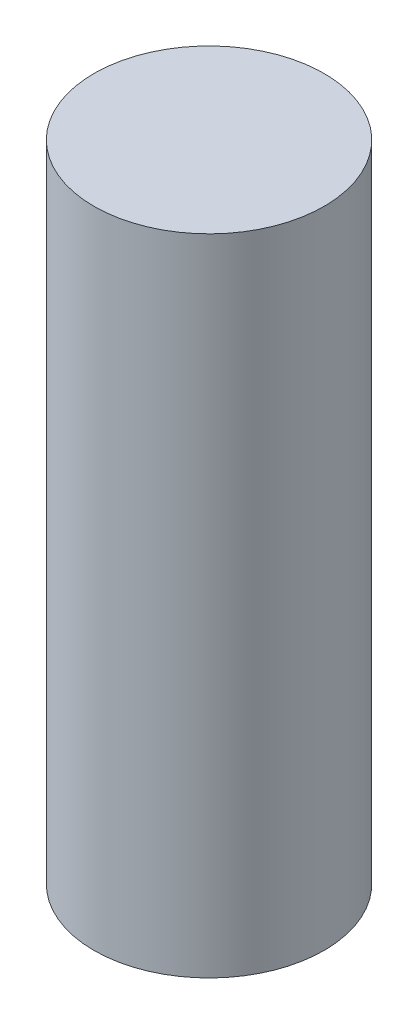
ISO-10303-21;
HEADER;
FILE_DESCRIPTION(('STEP AP214'),'2;1');
FILE_NAME('part.step','',(''),(''),'','','');
FILE_SCHEMA(('AUTOMOTIVE_DESIGN { 1 0 10303 214 1 1 1 1 }'));
ENDSEC;
DATA;
#1=APPLICATION_CONTEXT('core data for automotive mechanical design processes');
#2=APPLICATION_PROTOCOL_DEFINITION('international standard','automotive_design',2000,#1);
#3=PRODUCT_CONTEXT('',#1,'mechanical');
#4=PRODUCT('Part','Part','',(#3));
#5=PRODUCT_RELATED_PRODUCT_CATEGORY('part','',(#4));
#6=PRODUCT_DEFINITION_FORMATION('','',#4);
#7=PRODUCT_DEFINITION_CONTEXT('part definition',#1,'design');
#8=PRODUCT_DEFINITION('design','',#6,#7);
#9=PRODUCT_DEFINITION_SHAPE('','',#8);
#10=(LENGTH_UNIT() NAMED_UNIT(*) SI_UNIT(.MILLI.,.METRE.));
#11=(NAMED_UNIT(*) PLANE_ANGLE_UNIT() SI_UNIT($,.RADIAN.));
#12=(NAMED_UNIT(*) SI_UNIT($,.STERADIAN.) SOLID_ANGLE_UNIT());
#13=UNCERTAINTY_MEASURE_WITH_UNIT(LENGTH_MEASURE(1.E-05),#10,'distance_accuracy_value','');
#14=(GEOMETRIC_REPRESENTATION_CONTEXT(3) GLOBAL_UNCERTAINTY_ASSIGNED_CONTEXT((#13)) GLOBAL_UNIT_ASSIGNED_CONTEXT((#10,
#11,#12)) REPRESENTATION_CONTEXT('',''));
#15=CARTESIAN_POINT('',(0.,0.,0.));
#16=DIRECTION('',(0.,0.,1.));
#17=DIRECTION('',(1.,0.,0.));
#18=AXIS2_PLACEMENT_3D('',#15,#16,#17);
#19=CARTESIAN_POINT('',(0.,17.78,0.));
#20=DIRECTION('',(0.,-1.,0.));
#21=DIRECTION('',(0.,0.,-1.));
#22=AXIS2_PLACEMENT_3D('',#19,#20,#21);
#23=CYLINDRICAL_SURFACE('',#22,3.175);
#24=CARTESIAN_POINT('',(0.,17.78,0.));
#25=DIRECTION('',(0.,1.,0.));
#26=DIRECTION('',(0.,0.,1.));
#27=AXIS2_PLACEMENT_3D('',#24,#25,#26);
#28=CIRCLE('',#27,3.175);
#29=CARTESIAN_POINT('',(0.,17.78,3.175));
#30=VERTEX_POINT('',#29);
#31=EDGE_CURVE('E10',#30,#30,#28,.T.);
#32=ORIENTED_EDGE('',*,*,#31,.F.);
#33=EDGE_LOOP('',(#32));
#34=FACE_BOUND('',#33,.T.);
#35=CARTESIAN_POINT('',(0.,0.,0.));
#36=DIRECTION('',(0.,1.,0.));
#37=DIRECTION('',(0.,0.,1.));
#38=AXIS2_PLACEMENT_3D('',#35,#36,#37);
#39=CIRCLE('',#38,3.175);
#40=CARTESIAN_POINT('',(0.,0.,3.175));
#41=VERTEX_POINT('',#40);
#42=EDGE_CURVE('E34',#41,#41,#39,.T.);
#43=ORIENTED_EDGE('',*,*,#42,.T.);
#44=EDGE_LOOP('',(#43));
#45=FACE_BOUND('',#44,.T.);
#46=ADVANCED_FACE('F31',(#34,#45),#23,.T.);
#47=CARTESIAN_POINT('',(0.,17.78,0.));
#48=DIRECTION('',(0.,1.,0.));
#49=DIRECTION('',(0.,0.,1.));
#50=AXIS2_PLACEMENT_3D('',#47,#48,#49);
#51=PLANE('',#50);
#52=ORIENTED_EDGE('',*,*,#31,.T.);
#53=EDGE_LOOP('',(#52));
#54=FACE_BOUND('',#53,.T.);
#55=ADVANCED_FACE('F46',(#54),#51,.T.);
#56=CARTESIAN_POINT('',(0.,0.,0.));
#57=DIRECTION('',(0.,1.,0.));
#58=DIRECTION('',(0.,0.,1.));
#59=AXIS2_PLACEMENT_3D('',#56,#57,#58);
#60=PLANE('',#59);
#61=ORIENTED_EDGE('',*,*,#42,.F.);
#62=EDGE_LOOP('',(#61));
#63=FACE_BOUND('',#62,.T.);
#64=ADVANCED_FACE('F44',(#63),#60,.F.);
#65=CLOSED_SHELL('',(#46,#55,#64));
#66=MANIFOLD_SOLID_BREP('B2',#65);
#67=ADVANCED_BREP_SHAPE_REPRESENTATION('',(#18,#66),#14);
#68=SHAPE_DEFINITION_REPRESENTATION(#9,#67);
ENDSEC;
END-ISO-10303-21;
